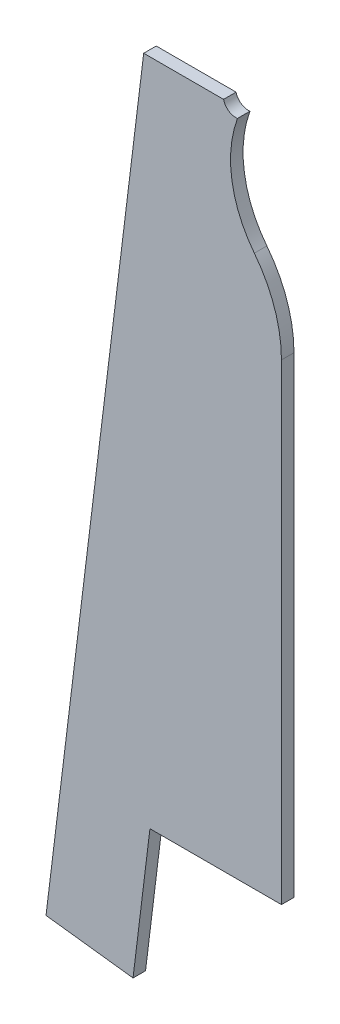
ISO-10303-21;
HEADER;
FILE_DESCRIPTION(('STEP AP214'),'2;1');
FILE_NAME('part.step','',(''),(''),'','','');
FILE_SCHEMA(('AUTOMOTIVE_DESIGN { 1 0 10303 214 1 1 1 1 }'));
ENDSEC;
DATA;
#1=APPLICATION_CONTEXT('core data for automotive mechanical design processes');
#2=APPLICATION_PROTOCOL_DEFINITION('international standard','automotive_design',2000,#1);
#3=PRODUCT_CONTEXT('',#1,'mechanical');
#4=PRODUCT('Part','Part','',(#3));
#5=PRODUCT_RELATED_PRODUCT_CATEGORY('part','',(#4));
#6=PRODUCT_DEFINITION_FORMATION('','',#4);
#7=PRODUCT_DEFINITION_CONTEXT('part definition',#1,'design');
#8=PRODUCT_DEFINITION('design','',#6,#7);
#9=PRODUCT_DEFINITION_SHAPE('','',#8);
#10=(LENGTH_UNIT() NAMED_UNIT(*) SI_UNIT(.MILLI.,.METRE.));
#11=(NAMED_UNIT(*) PLANE_ANGLE_UNIT() SI_UNIT($,.RADIAN.));
#12=(NAMED_UNIT(*) SI_UNIT($,.STERADIAN.) SOLID_ANGLE_UNIT());
#13=UNCERTAINTY_MEASURE_WITH_UNIT(LENGTH_MEASURE(1.E-05),#10,'distance_accuracy_value','');
#14=(GEOMETRIC_REPRESENTATION_CONTEXT(3) GLOBAL_UNCERTAINTY_ASSIGNED_CONTEXT((#13)) GLOBAL_UNIT_ASSIGNED_CONTEXT((#10,
#11,#12)) REPRESENTATION_CONTEXT('',''));
#15=CARTESIAN_POINT('',(0.,0.,0.));
#16=DIRECTION('',(0.,0.,1.));
#17=DIRECTION('',(1.,0.,0.));
#18=AXIS2_PLACEMENT_3D('',#15,#16,#17);
#19=CARTESIAN_POINT('',(95.7641730209773,95.7470621344799,6.35));
#20=DIRECTION('',(-1.,0.,0.));
#21=DIRECTION('',(0.,-1.,0.));
#22=AXIS2_PLACEMENT_3D('',#19,#20,#21);
#23=PLANE('',#22);
#24=DIRECTION('',(0.,0.,1.));
#25=VECTOR('',#24,1.);
#26=CARTESIAN_POINT('',(95.764173020977,334.935994433782,0.));
#27=LINE('',#26,#25);
#28=CARTESIAN_POINT('',(95.764173020977,334.935994433782,0.));
#29=VERTEX_POINT('',#28);
#30=CARTESIAN_POINT('',(95.764173020977,334.935994433782,6.35));
#31=VERTEX_POINT('',#30);
#32=EDGE_CURVE('E161',#29,#31,#27,.T.);
#33=ORIENTED_EDGE('',*,*,#32,.T.);
#34=DIRECTION('',(0.,1.,0.));
#35=VECTOR('',#34,1.);
#36=CARTESIAN_POINT('',(95.7641730209773,95.7470621344799,6.35));
#37=LINE('',#36,#35);
#38=CARTESIAN_POINT('',(95.7641730209773,95.7470621344799,6.35));
#39=VERTEX_POINT('',#38);
#40=EDGE_CURVE('E109',#39,#31,#37,.T.);
#41=ORIENTED_EDGE('',*,*,#40,.F.);
#42=DIRECTION('',(0.,0.,-1.));
#43=VECTOR('',#42,1.);
#44=CARTESIAN_POINT('',(95.7641730209773,95.7470621344799,6.35));
#45=LINE('',#44,#43);
#46=CARTESIAN_POINT('',(95.7641730209773,95.7470621344799,0.));
#47=VERTEX_POINT('',#46);
#48=EDGE_CURVE('E118',#39,#47,#45,.T.);
#49=ORIENTED_EDGE('',*,*,#48,.T.);
#50=DIRECTION('',(0.,1.,0.));
#51=VECTOR('',#50,1.);
#52=CARTESIAN_POINT('',(95.7641730209773,95.7470621344799,0.));
#53=LINE('',#52,#51);
#54=EDGE_CURVE('E133',#47,#29,#53,.T.);
#55=ORIENTED_EDGE('',*,*,#54,.T.);
#56=EDGE_LOOP('',(#33,#41,#49,#55));
#57=FACE_BOUND('',#56,.T.);
#58=ADVANCED_FACE('F34',(#57),#23,.F.);
#59=CARTESIAN_POINT('',(29.081649880651,95.7470621344798,6.35));
#60=DIRECTION('',(-0.992546151641323,0.121869343405143,0.));
#61=DIRECTION('',(-0.121869343405143,-0.992546151641323,0.));
#62=AXIS2_PLACEMENT_3D('',#59,#60,#61);
#63=PLANE('',#62);
#64=DIRECTION('',(0.121869343405143,0.992546151641323,0.));
#65=VECTOR('',#64,1.);
#66=CARTESIAN_POINT('',(29.081649880651,95.7470621344798,0.));
#67=LINE('',#66,#65);
#68=CARTESIAN_POINT('',(20.5051483015834,25.8970621344799,0.));
#69=VERTEX_POINT('',#68);
#70=CARTESIAN_POINT('',(29.081649880651,95.7470621344798,0.));
#71=VERTEX_POINT('',#70);
#72=EDGE_CURVE('E127',#69,#71,#67,.T.);
#73=ORIENTED_EDGE('',*,*,#72,.T.);
#74=DIRECTION('',(0.,0.,-1.));
#75=VECTOR('',#74,1.);
#76=CARTESIAN_POINT('',(29.081649880651,95.7470621344798,6.35));
#77=LINE('',#76,#75);
#78=CARTESIAN_POINT('',(29.081649880651,95.7470621344798,6.35));
#79=VERTEX_POINT('',#78);
#80=EDGE_CURVE('E42',#79,#71,#77,.T.);
#81=ORIENTED_EDGE('',*,*,#80,.F.);
#82=DIRECTION('',(0.121869343405143,0.992546151641323,0.));
#83=VECTOR('',#82,1.);
#84=CARTESIAN_POINT('',(29.081649880651,95.7470621344798,6.35));
#85=LINE('',#84,#83);
#86=CARTESIAN_POINT('',(20.5051483015834,25.8970621344799,6.35));
#87=VERTEX_POINT('',#86);
#88=EDGE_CURVE('E140',#87,#79,#85,.T.);
#89=ORIENTED_EDGE('',*,*,#88,.F.);
#90=DIRECTION('',(0.,0.,-1.));
#91=VECTOR('',#90,1.);
#92=CARTESIAN_POINT('',(20.5051483015834,25.8970621344799,6.35));
#93=LINE('',#92,#91);
#94=EDGE_CURVE('E123',#87,#69,#93,.T.);
#95=ORIENTED_EDGE('',*,*,#94,.T.);
#96=EDGE_LOOP('',(#73,#81,#89,#95));
#97=FACE_BOUND('',#96,.T.);
#98=ADVANCED_FACE('F36',(#97),#63,.F.);
#99=CARTESIAN_POINT('',(95.7641730209773,95.7470621344799,6.35));
#100=DIRECTION('',(0.,1.,0.));
#101=DIRECTION('',(-1.,0.,0.));
#102=AXIS2_PLACEMENT_3D('',#99,#100,#101);
#103=PLANE('',#102);
#104=DIRECTION('',(1.,0.,0.));
#105=VECTOR('',#104,1.);
#106=CARTESIAN_POINT('',(95.7641730209773,95.7470621344799,0.));
#107=LINE('',#106,#105);
#108=EDGE_CURVE('E130',#71,#47,#107,.T.);
#109=ORIENTED_EDGE('',*,*,#108,.T.);
#110=ORIENTED_EDGE('',*,*,#48,.F.);
#111=DIRECTION('',(1.,0.,0.));
#112=VECTOR('',#111,1.);
#113=CARTESIAN_POINT('',(95.7641730209773,95.7470621344799,6.35));
#114=LINE('',#113,#112);
#115=EDGE_CURVE('E90',#79,#39,#114,.T.);
#116=ORIENTED_EDGE('',*,*,#115,.F.);
#117=ORIENTED_EDGE('',*,*,#80,.T.);
#118=EDGE_LOOP('',(#109,#110,#116,#117));
#119=FACE_BOUND('',#118,.T.);
#120=ADVANCED_FACE('F145',(#119),#103,.F.);
#121=CARTESIAN_POINT('',(25.9141730209772,434.684910475872,6.35));
#122=DIRECTION('',(0.,-1.,0.));
#123=DIRECTION('',(1.,0.,0.));
#124=AXIS2_PLACEMENT_3D('',#121,#122,#123);
#125=PLANE('',#124);
#126=DIRECTION('',(-1.,0.,0.));
#127=VECTOR('',#126,1.);
#128=CARTESIAN_POINT('',(25.9141730209772,434.684910475872,6.35));
#129=LINE('',#128,#127);
#130=CARTESIAN_POINT('',(66.412753154869,434.684910475872,6.35));
#131=VERTEX_POINT('',#130);
#132=CARTESIAN_POINT('',(25.9141730209772,434.684910475872,6.35));
#133=VERTEX_POINT('',#132);
#134=EDGE_CURVE('E97',#131,#133,#129,.T.);
#135=ORIENTED_EDGE('',*,*,#134,.F.);
#136=DIRECTION('',(0.,0.,1.));
#137=VECTOR('',#136,1.);
#138=CARTESIAN_POINT('',(66.412753154869,434.684910475872,0.));
#139=LINE('',#138,#137);
#140=CARTESIAN_POINT('',(66.412753154869,434.684910475872,0.));
#141=VERTEX_POINT('',#140);
#142=EDGE_CURVE('E131',#131,#141,#139,.F.);
#143=ORIENTED_EDGE('',*,*,#142,.T.);
#144=DIRECTION('',(-1.,0.,0.));
#145=VECTOR('',#144,1.);
#146=CARTESIAN_POINT('',(25.9141730209772,434.684910475872,0.));
#147=LINE('',#146,#145);
#148=CARTESIAN_POINT('',(25.9141730209772,434.684910475872,0.));
#149=VERTEX_POINT('',#148);
#150=EDGE_CURVE('E115',#141,#149,#147,.T.);
#151=ORIENTED_EDGE('',*,*,#150,.T.);
#152=DIRECTION('',(0.,0.,-1.));
#153=VECTOR('',#152,1.);
#154=CARTESIAN_POINT('',(25.9141730209772,434.684910475872,6.35));
#155=LINE('',#154,#153);
#156=EDGE_CURVE('E112',#133,#149,#155,.T.);
#157=ORIENTED_EDGE('',*,*,#156,.F.);
#158=EDGE_LOOP('',(#135,#143,#151,#157));
#159=FACE_BOUND('',#158,.T.);
#160=ADVANCED_FACE('F113',(#159),#125,.F.);
#161=CARTESIAN_POINT('',(-23.6135281388733,31.3141544488385,6.35));
#162=DIRECTION('',(0.992546151641322,-0.121869343405144,0.));
#163=DIRECTION('',(0.121869343405144,0.992546151641322,0.));
#164=AXIS2_PLACEMENT_3D('',#161,#162,#163);
#165=PLANE('',#164);
#166=DIRECTION('',(-0.121869343405144,-0.992546151641322,0.));
#167=VECTOR('',#166,1.);
#168=CARTESIAN_POINT('',(-23.6135281388733,31.3141544488385,0.));
#169=LINE('',#168,#167);
#170=CARTESIAN_POINT('',(-23.6135281388733,31.3141544488385,0.));
#171=VERTEX_POINT('',#170);
#172=EDGE_CURVE('E137',#149,#171,#169,.T.);
#173=ORIENTED_EDGE('',*,*,#172,.T.);
#174=DIRECTION('',(0.,0.,-1.));
#175=VECTOR('',#174,1.);
#176=CARTESIAN_POINT('',(-23.6135281388733,31.3141544488385,6.35));
#177=LINE('',#176,#175);
#178=CARTESIAN_POINT('',(-23.6135281388733,31.3141544488385,6.35));
#179=VERTEX_POINT('',#178);
#180=EDGE_CURVE('E119',#179,#171,#177,.T.);
#181=ORIENTED_EDGE('',*,*,#180,.F.);
#182=DIRECTION('',(-0.121869343405144,-0.992546151641322,0.));
#183=VECTOR('',#182,1.);
#184=CARTESIAN_POINT('',(-23.6135281388733,31.3141544488385,6.35));
#185=LINE('',#184,#183);
#186=EDGE_CURVE('E102',#133,#179,#185,.T.);
#187=ORIENTED_EDGE('',*,*,#186,.F.);
#188=ORIENTED_EDGE('',*,*,#156,.T.);
#189=EDGE_LOOP('',(#173,#181,#187,#188));
#190=FACE_BOUND('',#189,.T.);
#191=ADVANCED_FACE('F121',(#190),#165,.F.);
#192=CARTESIAN_POINT('',(20.5051483015834,25.8970621344799,6.35));
#193=DIRECTION('',(0.121869343405143,0.992546151641323,0.));
#194=DIRECTION('',(-0.992546151641323,0.121869343405143,0.));
#195=AXIS2_PLACEMENT_3D('',#192,#193,#194);
#196=PLANE('',#195);
#197=DIRECTION('',(0.992546151641323,-0.121869343405143,0.));
#198=VECTOR('',#197,1.);
#199=CARTESIAN_POINT('',(20.5051483015834,25.8970621344799,0.));
#200=LINE('',#199,#198);
#201=EDGE_CURVE('E81',#171,#69,#200,.T.);
#202=ORIENTED_EDGE('',*,*,#201,.T.);
#203=ORIENTED_EDGE('',*,*,#94,.F.);
#204=DIRECTION('',(0.992546151641323,-0.121869343405143,0.));
#205=VECTOR('',#204,1.);
#206=CARTESIAN_POINT('',(20.5051483015834,25.8970621344799,6.35));
#207=LINE('',#206,#205);
#208=EDGE_CURVE('E57',#179,#87,#207,.T.);
#209=ORIENTED_EDGE('',*,*,#208,.F.);
#210=ORIENTED_EDGE('',*,*,#180,.T.);
#211=EDGE_LOOP('',(#202,#203,#209,#210));
#212=FACE_BOUND('',#211,.T.);
#213=ADVANCED_FACE('F198',(#212),#196,.F.);
#214=CARTESIAN_POINT('',(0.,0.,6.35));
#215=DIRECTION('',(0.,0.,-1.));
#216=DIRECTION('',(-1.,0.,0.));
#217=AXIS2_PLACEMENT_3D('',#214,#215,#216);
#218=PLANE('',#217);
#219=CARTESIAN_POINT('',(30.6766730209772,334.935994433785,6.35));
#220=DIRECTION('',(0.,0.,-1.));
#221=DIRECTION('',(-1.,0.,0.));
#222=AXIS2_PLACEMENT_3D('',#219,#220,#221);
#223=CIRCLE('',#222,65.0874999999997);
#224=CARTESIAN_POINT('',(82.0161598908013,374.943990436998,6.35));
#225=VERTEX_POINT('',#224);
#226=EDGE_CURVE('E186',#225,#31,#223,.T.);
#227=ORIENTED_EDGE('',*,*,#226,.F.);
#228=CARTESIAN_POINT('',(127.09473372772,410.072962537381,6.35));
#229=DIRECTION('',(0.,0.,1.));
#230=DIRECTION('',(1.,0.,0.));
#231=AXIS2_PLACEMENT_3D('',#228,#229,#230);
#232=CIRCLE('',#231,57.15);
#233=CARTESIAN_POINT('',(73.4745637946519,429.846679344013,6.35));
#234=VERTEX_POINT('',#233);
#235=EDGE_CURVE('E187',#234,#225,#232,.T.);
#236=ORIENTED_EDGE('',*,*,#235,.F.);
#237=CARTESIAN_POINT('',(72.594859493668,436.13544872624,6.35));
#238=DIRECTION('',(0.,0.,1.));
#239=DIRECTION('',(1.,0.,0.));
#240=AXIS2_PLACEMENT_3D('',#237,#238,#239);
#241=CIRCLE('',#240,6.34999999999999);
#242=EDGE_CURVE('E106',#131,#234,#241,.T.);
#243=ORIENTED_EDGE('',*,*,#242,.F.);
#244=ORIENTED_EDGE('',*,*,#134,.T.);
#245=ORIENTED_EDGE('',*,*,#186,.T.);
#246=ORIENTED_EDGE('',*,*,#208,.T.);
#247=ORIENTED_EDGE('',*,*,#88,.T.);
#248=ORIENTED_EDGE('',*,*,#115,.T.);
#249=ORIENTED_EDGE('',*,*,#40,.T.);
#250=EDGE_LOOP('',(#227,#236,#243,#244,#245,#246,#247,#248,#249));
#251=FACE_BOUND('',#250,.T.);
#252=ADVANCED_FACE('F100',(#251),#218,.F.);
#253=CARTESIAN_POINT('',(0.,0.,0.));
#254=DIRECTION('',(0.,0.,-1.));
#255=DIRECTION('',(-1.,0.,0.));
#256=AXIS2_PLACEMENT_3D('',#253,#254,#255);
#257=PLANE('',#256);
#258=CARTESIAN_POINT('',(127.09473372772,410.072962537381,0.));
#259=DIRECTION('',(0.,0.,1.));
#260=DIRECTION('',(1.,0.,0.));
#261=AXIS2_PLACEMENT_3D('',#258,#259,#260);
#262=CIRCLE('',#261,57.15);
#263=CARTESIAN_POINT('',(73.4745637946519,429.846679344013,0.));
#264=VERTEX_POINT('',#263);
#265=CARTESIAN_POINT('',(82.0161598908013,374.943990436998,0.));
#266=VERTEX_POINT('',#265);
#267=EDGE_CURVE('E49',#264,#266,#262,.T.);
#268=ORIENTED_EDGE('',*,*,#267,.T.);
#269=CARTESIAN_POINT('',(30.6766730209772,334.935994433785,0.));
#270=DIRECTION('',(0.,0.,-1.));
#271=DIRECTION('',(-1.,0.,0.));
#272=AXIS2_PLACEMENT_3D('',#269,#270,#271);
#273=CIRCLE('',#272,65.0874999999997);
#274=EDGE_CURVE('E155',#266,#29,#273,.T.);
#275=ORIENTED_EDGE('',*,*,#274,.T.);
#276=ORIENTED_EDGE('',*,*,#54,.F.);
#277=ORIENTED_EDGE('',*,*,#108,.F.);
#278=ORIENTED_EDGE('',*,*,#72,.F.);
#279=ORIENTED_EDGE('',*,*,#201,.F.);
#280=ORIENTED_EDGE('',*,*,#172,.F.);
#281=ORIENTED_EDGE('',*,*,#150,.F.);
#282=CARTESIAN_POINT('',(72.594859493668,436.13544872624,0.));
#283=DIRECTION('',(0.,0.,1.));
#284=DIRECTION('',(1.,0.,0.));
#285=AXIS2_PLACEMENT_3D('',#282,#283,#284);
#286=CIRCLE('',#285,6.34999999999999);
#287=EDGE_CURVE('E179',#141,#264,#286,.T.);
#288=ORIENTED_EDGE('',*,*,#287,.T.);
#289=EDGE_LOOP('',(#268,#275,#276,#277,#278,#279,#280,#281,#288));
#290=FACE_BOUND('',#289,.T.);
#291=ADVANCED_FACE('F150',(#290),#257,.T.);
#292=CARTESIAN_POINT('',(72.594859493668,436.13544872624,0.));
#293=DIRECTION('',(0.,0.,1.));
#294=DIRECTION('',(1.,0.,0.));
#295=AXIS2_PLACEMENT_3D('',#292,#293,#294);
#296=CYLINDRICAL_SURFACE('',#295,6.34999999999999);
#297=ORIENTED_EDGE('',*,*,#242,.T.);
#298=DIRECTION('',(0.,0.,1.));
#299=VECTOR('',#298,1.);
#300=CARTESIAN_POINT('',(73.4745637946519,429.846679344013,3.175));
#301=LINE('',#300,#299);
#302=EDGE_CURVE('E11',#234,#264,#301,.F.);
#303=ORIENTED_EDGE('',*,*,#302,.T.);
#304=ORIENTED_EDGE('',*,*,#287,.F.);
#305=ORIENTED_EDGE('',*,*,#142,.F.);
#306=EDGE_LOOP('',(#297,#303,#304,#305));
#307=FACE_BOUND('',#306,.T.);
#308=ADVANCED_FACE('F180',(#307),#296,.F.);
#309=CARTESIAN_POINT('',(127.09473372772,410.072962537381,0.));
#310=DIRECTION('',(0.,0.,1.));
#311=DIRECTION('',(1.,0.,0.));
#312=AXIS2_PLACEMENT_3D('',#309,#310,#311);
#313=CYLINDRICAL_SURFACE('',#312,57.15);
#314=ORIENTED_EDGE('',*,*,#235,.T.);
#315=DIRECTION('',(0.,0.,1.));
#316=VECTOR('',#315,1.);
#317=CARTESIAN_POINT('',(82.0161598908013,374.943990436998,0.));
#318=LINE('',#317,#316);
#319=EDGE_CURVE('E195',#266,#225,#318,.T.);
#320=ORIENTED_EDGE('',*,*,#319,.F.);
#321=ORIENTED_EDGE('',*,*,#267,.F.);
#322=ORIENTED_EDGE('',*,*,#302,.F.);
#323=EDGE_LOOP('',(#314,#320,#321,#322));
#324=FACE_BOUND('',#323,.T.);
#325=ADVANCED_FACE('F197',(#324),#313,.F.);
#326=CARTESIAN_POINT('',(30.6766730209772,334.935994433785,0.));
#327=DIRECTION('',(0.,0.,1.));
#328=DIRECTION('',(1.,0.,0.));
#329=AXIS2_PLACEMENT_3D('',#326,#327,#328);
#330=CYLINDRICAL_SURFACE('',#329,65.0874999999997);
#331=ORIENTED_EDGE('',*,*,#226,.T.);
#332=ORIENTED_EDGE('',*,*,#32,.F.);
#333=ORIENTED_EDGE('',*,*,#274,.F.);
#334=ORIENTED_EDGE('',*,*,#319,.T.);
#335=EDGE_LOOP('',(#331,#332,#333,#334));
#336=FACE_BOUND('',#335,.T.);
#337=ADVANCED_FACE('F196',(#336),#330,.T.);
#338=CLOSED_SHELL('',(#58,#98,#120,#160,#191,#213,#252,#291,#308,#325,#337));
#339=MANIFOLD_SOLID_BREP('B2',#338);
#340=ADVANCED_BREP_SHAPE_REPRESENTATION('',(#18,#339),#14);
#341=SHAPE_DEFINITION_REPRESENTATION(#9,#340);
ENDSEC;
END-ISO-10303-21;
